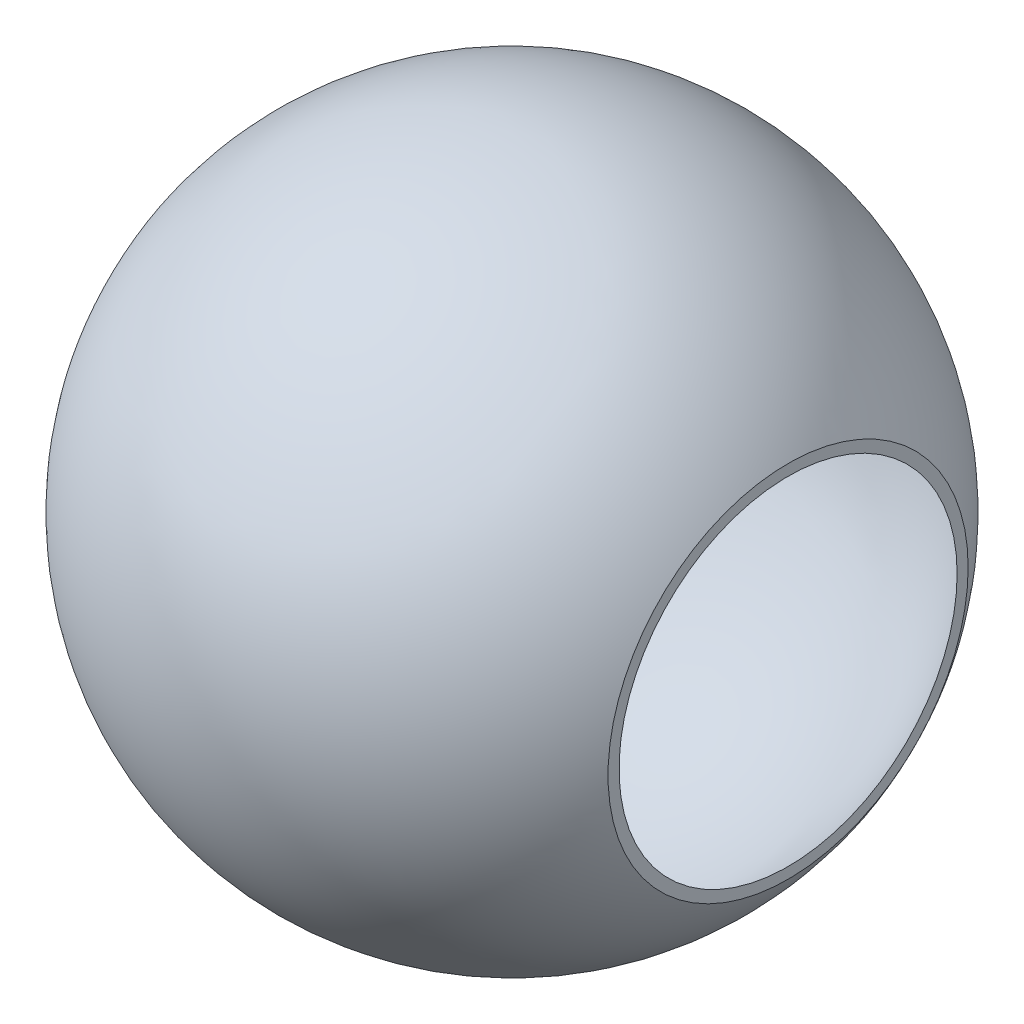
ISO-10303-21;
HEADER;
FILE_DESCRIPTION(('STEP AP214'),'2;1');
FILE_NAME('part.step','',(''),(''),'','','');
FILE_SCHEMA(('AUTOMOTIVE_DESIGN { 1 0 10303 214 1 1 1 1 }'));
ENDSEC;
DATA;
#1=APPLICATION_CONTEXT('core data for automotive mechanical design processes');
#2=APPLICATION_PROTOCOL_DEFINITION('international standard','automotive_design',2000,#1);
#3=PRODUCT_CONTEXT('',#1,'mechanical');
#4=PRODUCT('Part','Part','',(#3));
#5=PRODUCT_RELATED_PRODUCT_CATEGORY('part','',(#4));
#6=PRODUCT_DEFINITION_FORMATION('','',#4);
#7=PRODUCT_DEFINITION_CONTEXT('part definition',#1,'design');
#8=PRODUCT_DEFINITION('design','',#6,#7);
#9=PRODUCT_DEFINITION_SHAPE('','',#8);
#10=(LENGTH_UNIT() NAMED_UNIT(*) SI_UNIT(.MILLI.,.METRE.));
#11=(NAMED_UNIT(*) PLANE_ANGLE_UNIT() SI_UNIT($,.RADIAN.));
#12=(NAMED_UNIT(*) SI_UNIT($,.STERADIAN.) SOLID_ANGLE_UNIT());
#13=UNCERTAINTY_MEASURE_WITH_UNIT(LENGTH_MEASURE(1.E-05),#10,'distance_accuracy_value','');
#14=(GEOMETRIC_REPRESENTATION_CONTEXT(3) GLOBAL_UNCERTAINTY_ASSIGNED_CONTEXT((#13)) GLOBAL_UNIT_ASSIGNED_CONTEXT((#10,
#11,#12)) REPRESENTATION_CONTEXT('',''));
#15=CARTESIAN_POINT('',(0.,0.,0.));
#16=DIRECTION('',(0.,0.,1.));
#17=DIRECTION('',(1.,0.,0.));
#18=AXIS2_PLACEMENT_3D('',#15,#16,#17);
#19=CARTESIAN_POINT('',(-2.45,0.,0.));
#20=DIRECTION('',(1.,0.,0.));
#21=DIRECTION('',(0.,1.,0.));
#22=AXIS2_PLACEMENT_3D('',#19,#20,#21);
#23=PLANE('',#22);
#24=CARTESIAN_POINT('',(-2.45,0.,0.));
#25=DIRECTION('',(-1.,0.,0.));
#26=DIRECTION('',(0.,0.,-1.));
#27=AXIS2_PLACEMENT_3D('',#24,#25,#26);
#28=CIRCLE('',#27,1.50000673278489);
#29=CARTESIAN_POINT('',(-2.45,0.,-1.50000673278489));
#30=VERTEX_POINT('',#29);
#31=EDGE_CURVE('E9',#30,#30,#28,.T.);
#32=ORIENTED_EDGE('',*,*,#31,.F.);
#33=EDGE_LOOP('',(#32));
#34=FACE_BOUND('',#33,.T.);
#35=CARTESIAN_POINT('',(-2.45,0.,0.));
#36=DIRECTION('',(1.,0.,0.));
#37=DIRECTION('',(0.,0.,-1.));
#38=AXIS2_PLACEMENT_3D('',#35,#36,#37);
#39=CIRCLE('',#38,1.59785011812748);
#40=CARTESIAN_POINT('',(-2.45,0.,-1.59785011812748));
#41=VERTEX_POINT('',#40);
#42=EDGE_CURVE('E20',#41,#41,#39,.T.);
#43=ORIENTED_EDGE('',*,*,#42,.F.);
#44=EDGE_LOOP('',(#43));
#45=FACE_BOUND('',#44,.T.);
#46=ADVANCED_FACE('F13',(#34,#45),#23,.F.);
#47=CARTESIAN_POINT('',(0.,0.,0.));
#48=DIRECTION('',(1.,0.,0.));
#49=DIRECTION('',(0.,0.,-1.));
#50=AXIS2_PLACEMENT_3D('',#47,#48,#49);
#51=SPHERICAL_SURFACE('',#50,2.925);
#52=CARTESIAN_POINT('',(2.45,0.,0.));
#53=DIRECTION('',(-1.,0.,0.));
#54=DIRECTION('',(0.,0.,-1.));
#55=AXIS2_PLACEMENT_3D('',#52,#53,#54);
#56=CIRCLE('',#55,1.59785011812748);
#57=CARTESIAN_POINT('',(2.45,0.,-1.59785011812748));
#58=VERTEX_POINT('',#57);
#59=EDGE_CURVE('E26',#58,#58,#56,.T.);
#60=ORIENTED_EDGE('',*,*,#59,.T.);
#61=EDGE_LOOP('',(#60));
#62=FACE_BOUND('',#61,.T.);
#63=ORIENTED_EDGE('',*,*,#42,.T.);
#64=EDGE_LOOP('',(#63));
#65=FACE_BOUND('',#64,.T.);
#66=ADVANCED_FACE('F42',(#62,#65),#51,.T.);
#67=CARTESIAN_POINT('',(2.45,0.,0.));
#68=DIRECTION('',(-1.,0.,0.));
#69=DIRECTION('',(0.,-1.,0.));
#70=AXIS2_PLACEMENT_3D('',#67,#68,#69);
#71=PLANE('',#70);
#72=ORIENTED_EDGE('',*,*,#59,.F.);
#73=EDGE_LOOP('',(#72));
#74=FACE_BOUND('',#73,.T.);
#75=CARTESIAN_POINT('',(2.45,0.,0.));
#76=DIRECTION('',(1.,0.,0.));
#77=DIRECTION('',(0.,0.,-1.));
#78=AXIS2_PLACEMENT_3D('',#75,#76,#77);
#79=CIRCLE('',#78,1.50000673278489);
#80=CARTESIAN_POINT('',(2.45,0.,-1.50000673278489));
#81=VERTEX_POINT('',#80);
#82=EDGE_CURVE('E31',#81,#81,#79,.T.);
#83=ORIENTED_EDGE('',*,*,#82,.F.);
#84=EDGE_LOOP('',(#83));
#85=FACE_BOUND('',#84,.T.);
#86=ADVANCED_FACE('F40',(#74,#85),#71,.F.);
#87=CARTESIAN_POINT('',(0.,0.,0.));
#88=DIRECTION('',(1.,0.,0.));
#89=DIRECTION('',(0.,0.,-1.));
#90=AXIS2_PLACEMENT_3D('',#87,#88,#89);
#91=SPHERICAL_SURFACE('',#90,2.87272);
#92=ORIENTED_EDGE('',*,*,#82,.T.);
#93=EDGE_LOOP('',(#92));
#94=FACE_BOUND('',#93,.T.);
#95=ORIENTED_EDGE('',*,*,#31,.T.);
#96=EDGE_LOOP('',(#95));
#97=FACE_BOUND('',#96,.T.);
#98=ADVANCED_FACE('F38',(#94,#97),#91,.F.);
#99=CLOSED_SHELL('',(#46,#66,#86,#98));
#100=MANIFOLD_SOLID_BREP('B1',#99);
#101=ADVANCED_BREP_SHAPE_REPRESENTATION('',(#18,#100),#14);
#102=SHAPE_DEFINITION_REPRESENTATION(#9,#101);
ENDSEC;
END-ISO-10303-21;
